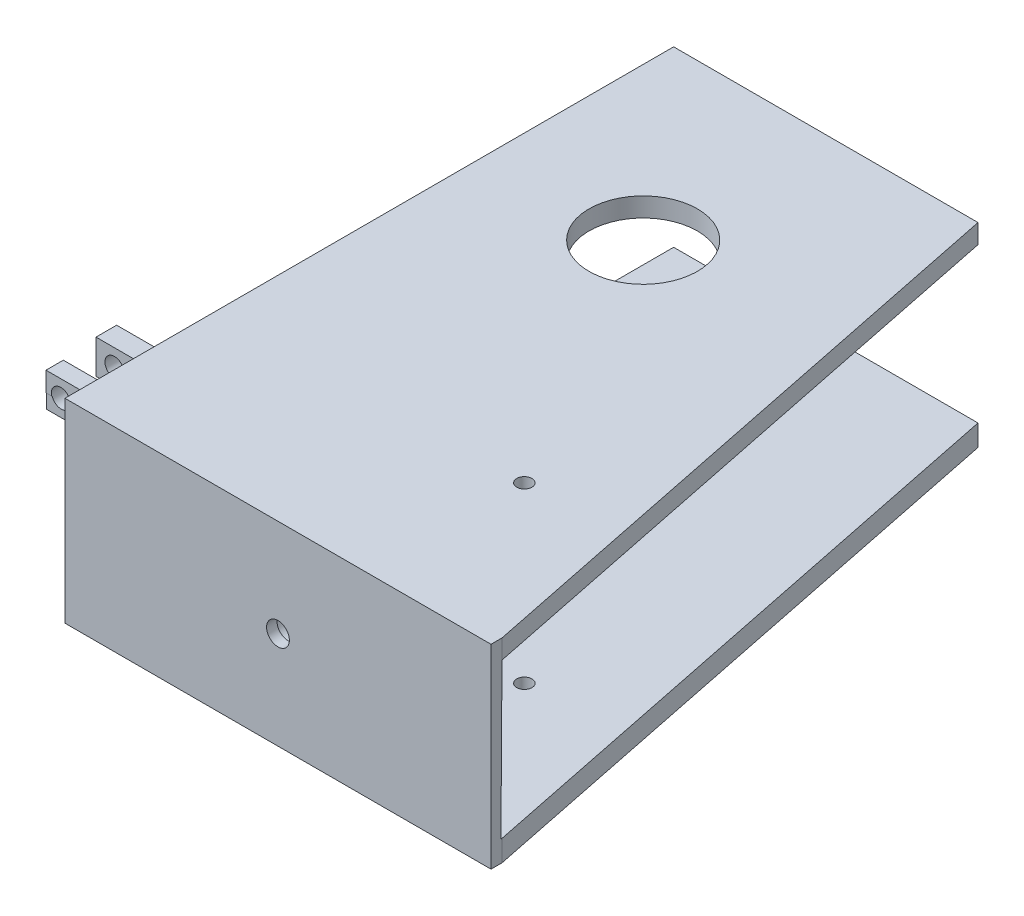
ISO-10303-21;
HEADER;
FILE_DESCRIPTION(('STEP AP214'),'2;1');
FILE_NAME('part.step','',(''),(''),'','','');
FILE_SCHEMA(('AUTOMOTIVE_DESIGN { 1 0 10303 214 1 1 1 1 }'));
ENDSEC;
DATA;
#1=APPLICATION_CONTEXT('core data for automotive mechanical design processes');
#2=APPLICATION_PROTOCOL_DEFINITION('international standard','automotive_design',2000,#1);
#3=PRODUCT_CONTEXT('',#1,'mechanical');
#4=PRODUCT('Part','Part','',(#3));
#5=PRODUCT_RELATED_PRODUCT_CATEGORY('part','',(#4));
#6=PRODUCT_DEFINITION_FORMATION('','',#4);
#7=PRODUCT_DEFINITION_CONTEXT('part definition',#1,'design');
#8=PRODUCT_DEFINITION('design','',#6,#7);
#9=PRODUCT_DEFINITION_SHAPE('','',#8);
#10=(LENGTH_UNIT() NAMED_UNIT(*) SI_UNIT(.MILLI.,.METRE.));
#11=(NAMED_UNIT(*) PLANE_ANGLE_UNIT() SI_UNIT($,.RADIAN.));
#12=(NAMED_UNIT(*) SI_UNIT($,.STERADIAN.) SOLID_ANGLE_UNIT());
#13=UNCERTAINTY_MEASURE_WITH_UNIT(LENGTH_MEASURE(1.E-05),#10,'distance_accuracy_value','');
#14=(GEOMETRIC_REPRESENTATION_CONTEXT(3) GLOBAL_UNCERTAINTY_ASSIGNED_CONTEXT((#13)) GLOBAL_UNIT_ASSIGNED_CONTEXT((#10,
#11,#12)) REPRESENTATION_CONTEXT('',''));
#15=CARTESIAN_POINT('',(0.,0.,0.));
#16=DIRECTION('',(0.,0.,1.));
#17=DIRECTION('',(1.,0.,0.));
#18=AXIS2_PLACEMENT_3D('',#15,#16,#17);
#19=CARTESIAN_POINT('',(23.876,-11.1057730017101,193.729110331207));
#20=DIRECTION('',(0.,1.,0.));
#21=DIRECTION('',(0.,0.,1.));
#22=AXIS2_PLACEMENT_3D('',#19,#20,#21);
#23=PLANE('',#22);
#24=DIRECTION('',(0.,0.,-1.));
#25=VECTOR('',#24,1.);
#26=CARTESIAN_POINT('',(-12.0893148253809,-11.1057730017101,207.01));
#27=LINE('',#26,#25);
#28=CARTESIAN_POINT('',(-12.0893148253809,-11.1057730017101,193.548));
#29=VERTEX_POINT('',#28);
#30=CARTESIAN_POINT('',(-12.0893148253809,-11.1057730017101,193.729110331207));
#31=VERTEX_POINT('',#30);
#32=EDGE_CURVE('E195',#29,#31,#27,.F.);
#33=ORIENTED_EDGE('',*,*,#32,.F.);
#34=DIRECTION('',(-1.,0.,0.));
#35=VECTOR('',#34,1.);
#36=CARTESIAN_POINT('',(23.876,-11.1057730017101,193.548));
#37=LINE('',#36,#35);
#38=CARTESIAN_POINT('',(23.876,-11.1057730017101,193.548));
#39=VERTEX_POINT('',#38);
#40=EDGE_CURVE('E205',#39,#29,#37,.T.);
#41=ORIENTED_EDGE('',*,*,#40,.F.);
#42=DIRECTION('',(0.,0.,-1.));
#43=VECTOR('',#42,1.);
#44=CARTESIAN_POINT('',(23.876,-11.1057730017101,193.729110331207));
#45=LINE('',#44,#43);
#46=CARTESIAN_POINT('',(23.876,-11.1057730017101,193.729110331207));
#47=VERTEX_POINT('',#46);
#48=EDGE_CURVE('E253',#47,#39,#45,.T.);
#49=ORIENTED_EDGE('',*,*,#48,.F.);
#50=DIRECTION('',(-1.,0.,0.));
#51=VECTOR('',#50,1.);
#52=CARTESIAN_POINT('',(23.876,-11.1057730017101,193.729110331207));
#53=LINE('',#52,#51);
#54=EDGE_CURVE('E208',#47,#31,#53,.T.);
#55=ORIENTED_EDGE('',*,*,#54,.T.);
#56=EDGE_LOOP('',(#33,#41,#49,#55));
#57=FACE_BOUND('',#56,.T.);
#58=ADVANCED_FACE('F33',(#57),#23,.F.);
#59=DIRECTION('',(0.,0.,-1.));
#60=VECTOR('',#59,1.);
#61=CARTESIAN_POINT('',(-19.7339467037339,-11.1057730017101,207.01));
#62=LINE('',#61,#60);
#63=CARTESIAN_POINT('',(-19.7339467037339,-11.1057730017101,193.729110331207));
#64=VERTEX_POINT('',#63);
#65=CARTESIAN_POINT('',(-19.7339467037339,-11.1057730017101,193.548));
#66=VERTEX_POINT('',#65);
#67=EDGE_CURVE('E51',#64,#66,#62,.T.);
#68=ORIENTED_EDGE('',*,*,#67,.F.);
#69=CARTESIAN_POINT('',(-22.098,-11.1057730017101,193.729110331207));
#70=VERTEX_POINT('',#69);
#71=EDGE_CURVE('E262',#64,#70,#53,.T.);
#72=ORIENTED_EDGE('',*,*,#71,.T.);
#73=DIRECTION('',(0.,0.,-1.));
#74=VECTOR('',#73,1.);
#75=CARTESIAN_POINT('',(-22.098,-11.1057730017101,193.729110331207));
#76=LINE('',#75,#74);
#77=CARTESIAN_POINT('',(-22.098,-11.1057730017101,193.548));
#78=VERTEX_POINT('',#77);
#79=EDGE_CURVE('E242',#70,#78,#76,.T.);
#80=ORIENTED_EDGE('',*,*,#79,.T.);
#81=EDGE_CURVE('E37',#66,#78,#37,.T.);
#82=ORIENTED_EDGE('',*,*,#81,.F.);
#83=EDGE_LOOP('',(#68,#72,#80,#82));
#84=FACE_BOUND('',#83,.T.);
#85=ADVANCED_FACE('F409',(#84),#23,.F.);
#86=CARTESIAN_POINT('',(23.876,-2.91945477341836,193.729110331207));
#87=DIRECTION('',(0.,0.,-1.));
#88=DIRECTION('',(-1.,0.,0.));
#89=AXIS2_PLACEMENT_3D('',#86,#87,#88);
#90=PLANE('',#89);
#91=CARTESIAN_POINT('',(-15.9116307645574,-10.0235836399452,193.729110331207));
#92=DIRECTION('',(0.,0.,-1.));
#93=DIRECTION('',(-1.,0.,0.));
#94=AXIS2_PLACEMENT_3D('',#91,#92,#93);
#95=CIRCLE('',#94,3.97256);
#96=EDGE_CURVE('E209',#31,#64,#95,.F.);
#97=ORIENTED_EDGE('',*,*,#96,.F.);
#98=ORIENTED_EDGE('',*,*,#54,.F.);
#99=DIRECTION('',(0.,-1.,0.));
#100=VECTOR('',#99,1.);
#101=CARTESIAN_POINT('',(23.876,-2.91945477341836,193.729110331207));
#102=LINE('',#101,#100);
#103=CARTESIAN_POINT('',(23.876,-2.91945477341836,193.729110331207));
#104=VERTEX_POINT('',#103);
#105=EDGE_CURVE('E256',#104,#47,#102,.T.);
#106=ORIENTED_EDGE('',*,*,#105,.F.);
#107=DIRECTION('',(-1.,0.,0.));
#108=VECTOR('',#107,1.);
#109=CARTESIAN_POINT('',(23.876,-2.91945477341836,193.729110331207));
#110=LINE('',#109,#108);
#111=CARTESIAN_POINT('',(0.,-2.91945477341836,193.729110331207));
#112=VERTEX_POINT('',#111);
#113=EDGE_CURVE('E266',#104,#112,#110,.T.);
#114=ORIENTED_EDGE('',*,*,#113,.T.);
#115=CARTESIAN_POINT('',(-22.098,-2.91945477341836,193.729110331207));
#116=VERTEX_POINT('',#115);
#117=EDGE_CURVE('E265',#112,#116,#110,.T.);
#118=ORIENTED_EDGE('',*,*,#117,.T.);
#119=DIRECTION('',(0.,-1.,0.));
#120=VECTOR('',#119,1.);
#121=CARTESIAN_POINT('',(-22.098,-2.91945477341836,193.729110331207));
#122=LINE('',#121,#120);
#123=EDGE_CURVE('E239',#116,#70,#122,.T.);
#124=ORIENTED_EDGE('',*,*,#123,.T.);
#125=ORIENTED_EDGE('',*,*,#71,.F.);
#126=EDGE_LOOP('',(#97,#98,#106,#114,#118,#124,#125));
#127=FACE_BOUND('',#126,.T.);
#128=ADVANCED_FACE('F414',(#127),#90,.F.);
#129=CARTESIAN_POINT('',(23.876,-11.1057730017101,186.496169951431));
#130=DIRECTION('',(0.,0.,1.));
#131=DIRECTION('',(1.,0.,0.));
#132=AXIS2_PLACEMENT_3D('',#129,#130,#131);
#133=PLANE('',#132);
#134=DIRECTION('',(0.,1.,0.));
#135=VECTOR('',#134,1.);
#136=CARTESIAN_POINT('',(23.876,-11.1057730017101,186.496169951431));
#137=LINE('',#136,#135);
#138=CARTESIAN_POINT('',(23.876,-17.127712506472,186.496169951431));
#139=VERTEX_POINT('',#138);
#140=CARTESIAN_POINT('',(23.876,-2.91945477341836,186.496169951431));
#141=VERTEX_POINT('',#140);
#142=EDGE_CURVE('E255',#139,#141,#137,.T.);
#143=ORIENTED_EDGE('',*,*,#142,.F.);
#144=DIRECTION('',(1.,0.,0.));
#145=VECTOR('',#144,1.);
#146=CARTESIAN_POINT('',(-81.534,-17.127712506472,186.496169951431));
#147=LINE('',#146,#145);
#148=CARTESIAN_POINT('',(-22.098,-17.127712506472,186.496169951431));
#149=VERTEX_POINT('',#148);
#150=EDGE_CURVE('E221',#149,#139,#147,.T.);
#151=ORIENTED_EDGE('',*,*,#150,.F.);
#152=DIRECTION('',(0.,1.,0.));
#153=VECTOR('',#152,1.);
#154=CARTESIAN_POINT('',(-22.098,-11.1057730017101,186.496169951431));
#155=LINE('',#154,#153);
#156=CARTESIAN_POINT('',(-22.098,-2.91945477341836,186.496169951431));
#157=VERTEX_POINT('',#156);
#158=EDGE_CURVE('E251',#149,#157,#155,.T.);
#159=ORIENTED_EDGE('',*,*,#158,.T.);
#160=DIRECTION('',(-1.,0.,0.));
#161=VECTOR('',#160,1.);
#162=CARTESIAN_POINT('',(23.876,-2.91945477341836,186.496169951431));
#163=LINE('',#162,#161);
#164=CARTESIAN_POINT('',(0.,-2.91945477341836,186.496169951431));
#165=VERTEX_POINT('',#164);
#166=EDGE_CURVE('E263',#165,#157,#163,.T.);
#167=ORIENTED_EDGE('',*,*,#166,.F.);
#168=EDGE_CURVE('E259',#141,#165,#163,.T.);
#169=ORIENTED_EDGE('',*,*,#168,.F.);
#170=EDGE_LOOP('',(#143,#151,#159,#167,#169));
#171=FACE_BOUND('',#170,.T.);
#172=CARTESIAN_POINT('',(-15.9116307645574,-10.0235836399452,186.496169951431));
#173=DIRECTION('',(0.,0.,1.));
#174=DIRECTION('',(1.,0.,0.));
#175=AXIS2_PLACEMENT_3D('',#172,#173,#174);
#176=CIRCLE('',#175,3.97256);
#177=CARTESIAN_POINT('',(-11.9390707645574,-10.0235836399452,186.496169951431));
#178=VERTEX_POINT('',#177);
#179=EDGE_CURVE('E427',#178,#178,#176,.F.);
#180=ORIENTED_EDGE('',*,*,#179,.F.);
#181=EDGE_LOOP('',(#180));
#182=FACE_BOUND('',#181,.T.);
#183=ADVANCED_FACE('F418',(#171,#182),#133,.F.);
#184=CARTESIAN_POINT('',(0.,0.,193.548));
#185=DIRECTION('',(0.,0.,1.));
#186=DIRECTION('',(1.,0.,0.));
#187=AXIS2_PLACEMENT_3D('',#184,#185,#186);
#188=PLANE('',#187);
#189=ORIENTED_EDGE('',*,*,#40,.T.);
#190=CARTESIAN_POINT('',(-15.9116307645574,-10.0235836399452,193.548));
#191=DIRECTION('',(0.,0.,1.));
#192=DIRECTION('',(1.,0.,0.));
#193=AXIS2_PLACEMENT_3D('',#190,#191,#192);
#194=CIRCLE('',#193,3.97256);
#195=EDGE_CURVE('E191',#29,#66,#194,.F.);
#196=ORIENTED_EDGE('',*,*,#195,.T.);
#197=ORIENTED_EDGE('',*,*,#81,.T.);
#198=DIRECTION('',(0.,-1.,0.));
#199=VECTOR('',#198,1.);
#200=CARTESIAN_POINT('',(-22.098,-11.1057730017101,193.548));
#201=LINE('',#200,#199);
#202=CARTESIAN_POINT('',(-22.098,-17.127712506472,193.548));
#203=VERTEX_POINT('',#202);
#204=EDGE_CURVE('E216',#78,#203,#201,.T.);
#205=ORIENTED_EDGE('',*,*,#204,.T.);
#206=DIRECTION('',(1.,0.,0.));
#207=VECTOR('',#206,1.);
#208=CARTESIAN_POINT('',(-22.098,-17.127712506472,193.548));
#209=LINE('',#208,#207);
#210=CARTESIAN_POINT('',(23.876,-17.127712506472,193.548));
#211=VERTEX_POINT('',#210);
#212=EDGE_CURVE('E219',#203,#211,#209,.T.);
#213=ORIENTED_EDGE('',*,*,#212,.T.);
#214=DIRECTION('',(0.,1.,0.));
#215=VECTOR('',#214,1.);
#216=CARTESIAN_POINT('',(23.876,-17.127712506472,193.548));
#217=LINE('',#216,#215);
#218=EDGE_CURVE('E215',#211,#39,#217,.T.);
#219=ORIENTED_EDGE('',*,*,#218,.T.);
#220=EDGE_LOOP('',(#189,#196,#197,#205,#213,#219));
#221=FACE_BOUND('',#220,.T.);
#222=ADVANCED_FACE('F212',(#221),#188,.T.);
#223=CARTESIAN_POINT('',(22.86,-17.127712506472,171.341437727139));
#224=DIRECTION('',(0.,0.,-1.));
#225=DIRECTION('',(-1.,0.,0.));
#226=AXIS2_PLACEMENT_3D('',#223,#224,#225);
#227=PLANE('',#226);
#228=DIRECTION('',(-1.,0.,0.));
#229=VECTOR('',#228,1.);
#230=CARTESIAN_POINT('',(22.86,-2.91945477341836,171.341437727139));
#231=LINE('',#230,#229);
#232=CARTESIAN_POINT('',(22.86,-2.91945477341836,171.341437727139));
#233=VERTEX_POINT('',#232);
#234=CARTESIAN_POINT('',(0.,-2.91945477341836,171.341437727139));
#235=VERTEX_POINT('',#234);
#236=EDGE_CURVE('E59',#233,#235,#231,.T.);
#237=ORIENTED_EDGE('',*,*,#236,.T.);
#238=CARTESIAN_POINT('',(-23.622,-2.91945477341836,171.341437727139));
#239=VERTEX_POINT('',#238);
#240=EDGE_CURVE('E461',#235,#239,#231,.T.);
#241=ORIENTED_EDGE('',*,*,#240,.T.);
#242=DIRECTION('',(0.,-1.,0.));
#243=VECTOR('',#242,1.);
#244=CARTESIAN_POINT('',(-23.622,-17.127712506472,171.341437727139));
#245=LINE('',#244,#243);
#246=CARTESIAN_POINT('',(-23.622,-17.127712506472,171.341437727139));
#247=VERTEX_POINT('',#246);
#248=EDGE_CURVE('E436',#239,#247,#245,.T.);
#249=ORIENTED_EDGE('',*,*,#248,.T.);
#250=DIRECTION('',(-1.,0.,0.));
#251=VECTOR('',#250,1.);
#252=CARTESIAN_POINT('',(22.86,-17.127712506472,171.341437727139));
#253=LINE('',#252,#251);
#254=CARTESIAN_POINT('',(22.86,-17.127712506472,171.341437727139));
#255=VERTEX_POINT('',#254);
#256=EDGE_CURVE('E460',#255,#247,#253,.T.);
#257=ORIENTED_EDGE('',*,*,#256,.F.);
#258=DIRECTION('',(0.,-1.,0.));
#259=VECTOR('',#258,1.);
#260=CARTESIAN_POINT('',(22.86,-17.127712506472,171.341437727139));
#261=LINE('',#260,#259);
#262=EDGE_CURVE('E448',#233,#255,#261,.T.);
#263=ORIENTED_EDGE('',*,*,#262,.F.);
#264=EDGE_LOOP('',(#237,#241,#249,#257,#263));
#265=FACE_BOUND('',#264,.T.);
#266=CARTESIAN_POINT('',(-15.9116307645574,-10.0235836399452,171.341437727139));
#267=DIRECTION('',(0.,0.,-1.));
#268=DIRECTION('',(-1.,0.,0.));
#269=AXIS2_PLACEMENT_3D('',#266,#267,#268);
#270=CIRCLE('',#269,3.97256);
#271=CARTESIAN_POINT('',(-19.8841907645574,-10.0235836399452,171.341437727139));
#272=VERTEX_POINT('',#271);
#273=EDGE_CURVE('E200',#272,#272,#270,.F.);
#274=ORIENTED_EDGE('',*,*,#273,.F.);
#275=EDGE_LOOP('',(#274));
#276=FACE_BOUND('',#275,.T.);
#277=ADVANCED_FACE('F464',(#265,#276),#227,.F.);
#278=CARTESIAN_POINT('',(22.86,-2.91945477341836,162.730794417882));
#279=DIRECTION('',(0.,0.,1.));
#280=DIRECTION('',(1.,0.,0.));
#281=AXIS2_PLACEMENT_3D('',#278,#279,#280);
#282=PLANE('',#281);
#283=DIRECTION('',(-1.,0.,0.));
#284=VECTOR('',#283,1.);
#285=CARTESIAN_POINT('',(22.86,-17.127712506472,162.730794417882));
#286=LINE('',#285,#284);
#287=CARTESIAN_POINT('',(22.86,-17.127712506472,162.730794417882));
#288=VERTEX_POINT('',#287);
#289=CARTESIAN_POINT('',(-23.622,-17.127712506472,162.730794417882));
#290=VERTEX_POINT('',#289);
#291=EDGE_CURVE('E458',#288,#290,#286,.T.);
#292=ORIENTED_EDGE('',*,*,#291,.T.);
#293=DIRECTION('',(0.,1.,0.));
#294=VECTOR('',#293,1.);
#295=CARTESIAN_POINT('',(-23.622,-2.91945477341836,162.730794417882));
#296=LINE('',#295,#294);
#297=CARTESIAN_POINT('',(-23.622,-2.91945477341836,162.730794417882));
#298=VERTEX_POINT('',#297);
#299=EDGE_CURVE('E442',#290,#298,#296,.T.);
#300=ORIENTED_EDGE('',*,*,#299,.T.);
#301=DIRECTION('',(-1.,0.,0.));
#302=VECTOR('',#301,1.);
#303=CARTESIAN_POINT('',(22.86,-2.91945477341836,162.730794417882));
#304=LINE('',#303,#302);
#305=CARTESIAN_POINT('',(0.,-2.91945477341836,162.730794417882));
#306=VERTEX_POINT('',#305);
#307=EDGE_CURVE('E454',#306,#298,#304,.T.);
#308=ORIENTED_EDGE('',*,*,#307,.F.);
#309=CARTESIAN_POINT('',(22.86,-2.91945477341836,162.730794417882));
#310=VERTEX_POINT('',#309);
#311=EDGE_CURVE('E455',#310,#306,#304,.T.);
#312=ORIENTED_EDGE('',*,*,#311,.F.);
#313=DIRECTION('',(0.,1.,0.));
#314=VECTOR('',#313,1.);
#315=CARTESIAN_POINT('',(22.86,-2.91945477341836,162.730794417882));
#316=LINE('',#315,#314);
#317=EDGE_CURVE('E452',#288,#310,#316,.T.);
#318=ORIENTED_EDGE('',*,*,#317,.F.);
#319=EDGE_LOOP('',(#292,#300,#308,#312,#318));
#320=FACE_BOUND('',#319,.T.);
#321=CARTESIAN_POINT('',(-15.9116307645574,-10.0235836399452,162.730794417882));
#322=DIRECTION('',(0.,0.,1.));
#323=DIRECTION('',(1.,0.,0.));
#324=AXIS2_PLACEMENT_3D('',#321,#322,#323);
#325=CIRCLE('',#324,3.97256);
#326=CARTESIAN_POINT('',(-11.9390707645574,-10.0235836399452,162.730794417882));
#327=VERTEX_POINT('',#326);
#328=EDGE_CURVE('E891',#327,#327,#325,.F.);
#329=ORIENTED_EDGE('',*,*,#328,.F.);
#330=EDGE_LOOP('',(#329));
#331=FACE_BOUND('',#330,.T.);
#332=ADVANCED_FACE('F479',(#320,#331),#282,.F.);
#333=CARTESIAN_POINT('',(208.534,-2.91945477341836,203.357682979943));
#334=DIRECTION('',(0.,-1.,0.));
#335=DIRECTION('',(0.,0.,-1.));
#336=AXIS2_PLACEMENT_3D('',#333,#334,#335);
#337=PLANE('',#336);
#338=CARTESIAN_POINT('',(126.414802626394,-2.91945477341837,142.640423394958));
#339=DIRECTION('',(0.,-1.,0.));
#340=DIRECTION('',(0.,0.,-1.));
#341=AXIS2_PLACEMENT_3D('',#338,#339,#340);
#342=CIRCLE('',#341,3.175);
#343=CARTESIAN_POINT('',(126.414802626394,-2.91945477341837,139.465423394958));
#344=VERTEX_POINT('',#343);
#345=EDGE_CURVE('E280',#344,#344,#342,.T.);
#346=ORIENTED_EDGE('',*,*,#345,.F.);
#347=EDGE_LOOP('',(#346));
#348=FACE_BOUND('',#347,.T.);
#349=CARTESIAN_POINT('',(63.5,-2.91945477341835,30.1296829799427));
#350=DIRECTION('',(0.,-1.,0.));
#351=DIRECTION('',(0.,0.,-1.));
#352=AXIS2_PLACEMENT_3D('',#349,#350,#351);
#353=CIRCLE('',#352,22.606);
#354=CARTESIAN_POINT('',(63.5,-2.91945477341835,7.5236829799427));
#355=VERTEX_POINT('',#354);
#356=EDGE_CURVE('E287',#355,#355,#353,.F.);
#357=ORIENTED_EDGE('',*,*,#356,.T.);
#358=EDGE_LOOP('',(#357));
#359=FACE_BOUND('',#358,.T.);
#360=DIRECTION('',(0.,0.,1.));
#361=VECTOR('',#360,1.);
#362=CARTESIAN_POINT('',(0.,-2.91945477341836,203.357682979943));
#363=LINE('',#362,#361);
#364=EDGE_CURVE('E302',#235,#165,#363,.T.);
#365=ORIENTED_EDGE('',*,*,#364,.F.);
#366=ORIENTED_EDGE('',*,*,#236,.F.);
#367=DIRECTION('',(0.,0.,1.));
#368=VECTOR('',#367,1.);
#369=CARTESIAN_POINT('',(22.86,-2.91945477341836,171.341437727139));
#370=LINE('',#369,#368);
#371=EDGE_CURVE('E445',#310,#233,#370,.T.);
#372=ORIENTED_EDGE('',*,*,#371,.F.);
#373=ORIENTED_EDGE('',*,*,#311,.T.);
#374=CARTESIAN_POINT('',(0.,-2.91945477341835,-46.0703170200573));
#375=VERTEX_POINT('',#374);
#376=EDGE_CURVE('E297',#375,#306,#363,.T.);
#377=ORIENTED_EDGE('',*,*,#376,.F.);
#378=DIRECTION('',(-1.,0.,0.));
#379=VECTOR('',#378,1.);
#380=CARTESIAN_POINT('',(208.534,-2.91945477341835,-46.0703170200573));
#381=LINE('',#380,#379);
#382=CARTESIAN_POINT('',(127.,-2.91945477341835,-46.0703170200573));
#383=VERTEX_POINT('',#382);
#384=EDGE_CURVE('E308',#383,#375,#381,.T.);
#385=ORIENTED_EDGE('',*,*,#384,.F.);
#386=DIRECTION('',(0.199568997239386,0.,0.979883776445384));
#387=VECTOR('',#386,1.);
#388=CARTESIAN_POINT('',(127.,-2.91945477341835,-46.0703170200573));
#389=LINE('',#388,#387);
#390=CARTESIAN_POINT('',(177.8,-2.91945477341836,203.357682979943));
#391=VERTEX_POINT('',#390);
#392=EDGE_CURVE('E321',#383,#391,#389,.T.);
#393=ORIENTED_EDGE('',*,*,#392,.T.);
#394=DIRECTION('',(-1.,0.,0.));
#395=VECTOR('',#394,1.);
#396=CARTESIAN_POINT('',(208.534,-2.91945477341836,203.357682979943));
#397=LINE('',#396,#395);
#398=CARTESIAN_POINT('',(0.,-2.91945477341836,203.357682979943));
#399=VERTEX_POINT('',#398);
#400=EDGE_CURVE('E316',#391,#399,#397,.T.);
#401=ORIENTED_EDGE('',*,*,#400,.T.);
#402=EDGE_CURVE('E296',#112,#399,#363,.T.);
#403=ORIENTED_EDGE('',*,*,#402,.F.);
#404=ORIENTED_EDGE('',*,*,#113,.F.);
#405=DIRECTION('',(0.,0.,1.));
#406=VECTOR('',#405,1.);
#407=CARTESIAN_POINT('',(23.876,-2.91945477341836,186.496169951431));
#408=LINE('',#407,#406);
#409=EDGE_CURVE('E245',#141,#104,#408,.T.);
#410=ORIENTED_EDGE('',*,*,#409,.F.);
#411=ORIENTED_EDGE('',*,*,#168,.T.);
#412=EDGE_LOOP('',(#365,#366,#372,#373,#377,#385,#393,#401,#403,#404,#410,#411));
#413=FACE_BOUND('',#412,.T.);
#414=ADVANCED_FACE('F484',(#348,#359,#413),#337,.T.);
#415=CARTESIAN_POINT('',(88.9,-35.56,-2.54));
#416=DIRECTION('',(0.,0.,1.));
#417=DIRECTION('',(1.,0.,0.));
#418=AXIS2_PLACEMENT_3D('',#415,#416,#417);
#419=CYLINDRICAL_SURFACE('',#418,9.023236634492);
#420=CARTESIAN_POINT('',(88.9,-35.56,203.577965846683));
#421=DIRECTION('',(0.,-0.00674859592335364,-0.999977227967249));
#422=DIRECTION('',(0.,-0.999977227967249,0.00674859592335364));
#423=AXIS2_PLACEMENT_3D('',#420,#421,#422);
#424=ELLIPSE('',#423,9.02344211661141,9.023236634492);
#425=CARTESIAN_POINT('',(88.9,-44.583236634492,203.638861411366));
#426=VERTEX_POINT('',#425);
#427=EDGE_CURVE('E11',#426,#426,#424,.T.);
#428=ORIENTED_EDGE('',*,*,#427,.T.);
#429=EDGE_LOOP('',(#428));
#430=FACE_BOUND('',#429,.T.);
#431=CARTESIAN_POINT('',(88.9,-35.56,192.958769134962));
#432=DIRECTION('',(0.,0.,-1.));
#433=DIRECTION('',(-1.,0.,0.));
#434=AXIS2_PLACEMENT_3D('',#431,#432,#433);
#435=CIRCLE('',#434,9.023236634492);
#436=CARTESIAN_POINT('',(79.876763365508,-35.56,192.958769134962));
#437=VERTEX_POINT('',#436);
#438=EDGE_CURVE('E268',#437,#437,#435,.F.);
#439=ORIENTED_EDGE('',*,*,#438,.T.);
#440=EDGE_LOOP('',(#439));
#441=FACE_BOUND('',#440,.T.);
#442=ADVANCED_FACE('F385',(#430,#441),#419,.T.);
#443=CARTESIAN_POINT('',(88.9,-35.56,-2.54));
#444=DIRECTION('',(0.,0.,1.));
#445=DIRECTION('',(1.,0.,0.));
#446=AXIS2_PLACEMENT_3D('',#443,#444,#445);
#447=CYLINDRICAL_SURFACE('',#446,5.41394198069519);
#448=CARTESIAN_POINT('',(88.9,-35.56,203.577965846683));
#449=DIRECTION('',(0.,-0.00674859592335364,-0.999977227967249));
#450=DIRECTION('',(0.,-0.999977227967249,0.00674859592335364));
#451=AXIS2_PLACEMENT_3D('',#448,#449,#450);
#452=ELLIPSE('',#451,5.41406526996684,5.41394198069519);
#453=CARTESIAN_POINT('',(88.9,-40.9739419806952,203.614503185493));
#454=VERTEX_POINT('',#453);
#455=EDGE_CURVE('E271',#454,#454,#452,.T.);
#456=ORIENTED_EDGE('',*,*,#455,.F.);
#457=EDGE_LOOP('',(#456));
#458=FACE_BOUND('',#457,.T.);
#459=CARTESIAN_POINT('',(88.9,-35.56,192.958769134962));
#460=DIRECTION('',(0.,0.,-1.));
#461=DIRECTION('',(-1.,0.,0.));
#462=AXIS2_PLACEMENT_3D('',#459,#460,#461);
#463=CIRCLE('',#462,5.41394198069519);
#464=CARTESIAN_POINT('',(83.4860580193048,-35.56,192.958769134962));
#465=VERTEX_POINT('',#464);
#466=EDGE_CURVE('E252',#465,#465,#463,.F.);
#467=ORIENTED_EDGE('',*,*,#466,.F.);
#468=EDGE_LOOP('',(#467));
#469=FACE_BOUND('',#468,.T.);
#470=ADVANCED_FACE('F382',(#458,#469),#447,.F.);
#471=CARTESIAN_POINT('',(208.534,-67.3527388570609,203.792527080522));
#472=DIRECTION('',(0.,-0.00674859592335364,-0.999977227967249));
#473=DIRECTION('',(0.,0.999977227967249,-0.00674859592335364));
#474=AXIS2_PLACEMENT_3D('',#471,#472,#473);
#475=PLANE('',#474);
#476=CARTESIAN_POINT('',(88.9,-35.56,203.577965846683));
#477=DIRECTION('',(0.,-0.00674859592335364,-0.999977227967249));
#478=DIRECTION('',(0.,0.999977227967249,-0.00674859592335364));
#479=AXIS2_PLACEMENT_3D('',#476,#477,#478);
#480=ELLIPSE('',#479,4.7626084542757,4.7625);
#481=CARTESIAN_POINT('',(88.9,-30.7975,203.545824926684));
#482=VERTEX_POINT('',#481);
#483=EDGE_CURVE('E276',#482,#482,#480,.F.);
#484=ORIENTED_EDGE('',*,*,#483,.T.);
#485=EDGE_LOOP('',(#484));
#486=FACE_BOUND('',#485,.T.);
#487=ORIENTED_EDGE('',*,*,#455,.T.);
#488=EDGE_LOOP('',(#487));
#489=FACE_BOUND('',#488,.T.);
#490=ADVANCED_FACE('F380',(#486,#489),#475,.T.);
#491=CARTESIAN_POINT('',(0.,4.572,207.929682979943));
#492=DIRECTION('',(0.,0.,-1.));
#493=DIRECTION('',(-1.,0.,0.));
#494=AXIS2_PLACEMENT_3D('',#491,#492,#493);
#495=PLANE('',#494);
#496=DIRECTION('',(0.,-1.,0.));
#497=VECTOR('',#496,1.);
#498=CARTESIAN_POINT('',(0.,4.572,207.929682979943));
#499=LINE('',#498,#497);
#500=CARTESIAN_POINT('',(0.,5.08,207.929682979943));
#501=VERTEX_POINT('',#500);
#502=CARTESIAN_POINT('',(0.,-76.2,207.929682979943));
#503=VERTEX_POINT('',#502);
#504=EDGE_CURVE('E359',#501,#503,#499,.T.);
#505=ORIENTED_EDGE('',*,*,#504,.T.);
#506=DIRECTION('',(1.,0.,0.));
#507=VECTOR('',#506,1.);
#508=CARTESIAN_POINT('',(177.8,-76.2,207.929682979943));
#509=LINE('',#508,#507);
#510=CARTESIAN_POINT('',(177.8,-76.2,207.929682979943));
#511=VERTEX_POINT('',#510);
#512=EDGE_CURVE('E323',#503,#511,#509,.T.);
#513=ORIENTED_EDGE('',*,*,#512,.T.);
#514=DIRECTION('',(0.,-1.,0.));
#515=VECTOR('',#514,1.);
#516=CARTESIAN_POINT('',(177.8,4.572,207.929682979943));
#517=LINE('',#516,#515);
#518=CARTESIAN_POINT('',(177.8,5.08,207.929682979943));
#519=VERTEX_POINT('',#518);
#520=EDGE_CURVE('E357',#519,#511,#517,.T.);
#521=ORIENTED_EDGE('',*,*,#520,.F.);
#522=DIRECTION('',(1.,0.,0.));
#523=VECTOR('',#522,1.);
#524=CARTESIAN_POINT('',(177.8,5.08,207.929682979943));
#525=LINE('',#524,#523);
#526=EDGE_CURVE('E336',#501,#519,#525,.T.);
#527=ORIENTED_EDGE('',*,*,#526,.F.);
#528=EDGE_LOOP('',(#505,#513,#521,#527));
#529=FACE_BOUND('',#528,.T.);
#530=CARTESIAN_POINT('',(88.9,-35.56,207.929682979943));
#531=DIRECTION('',(0.,0.,-1.));
#532=DIRECTION('',(-1.,0.,0.));
#533=AXIS2_PLACEMENT_3D('',#530,#531,#532);
#534=CIRCLE('',#533,4.7625);
#535=CARTESIAN_POINT('',(84.1375,-35.56,207.929682979943));
#536=VERTEX_POINT('',#535);
#537=EDGE_CURVE('E272',#536,#536,#534,.F.);
#538=ORIENTED_EDGE('',*,*,#537,.F.);
#539=EDGE_LOOP('',(#538));
#540=FACE_BOUND('',#539,.T.);
#541=ADVANCED_FACE('F532',(#529,#540),#495,.F.);
#542=ORIENTED_EDGE('',*,*,#427,.F.);
#543=EDGE_LOOP('',(#542));
#544=FACE_BOUND('',#543,.T.);
#545=DIRECTION('',(-1.,0.,0.));
#546=VECTOR('',#545,1.);
#547=CARTESIAN_POINT('',(208.534,-67.3527388570609,203.792527080522));
#548=LINE('',#547,#546);
#549=CARTESIAN_POINT('',(177.8,-67.3527388570609,203.792527080522));
#550=VERTEX_POINT('',#549);
#551=CARTESIAN_POINT('',(0.,-67.3527388570609,203.792527080522));
#552=VERTEX_POINT('',#551);
#553=EDGE_CURVE('E314',#550,#552,#548,.T.);
#554=ORIENTED_EDGE('',*,*,#553,.T.);
#555=DIRECTION('',(0.,-0.999977227967249,0.00674859592335364));
#556=VECTOR('',#555,1.);
#557=CARTESIAN_POINT('',(0.,-67.3527388570609,203.792527080522));
#558=LINE('',#557,#556);
#559=EDGE_CURVE('E300',#399,#552,#558,.T.);
#560=ORIENTED_EDGE('',*,*,#559,.F.);
#561=ORIENTED_EDGE('',*,*,#400,.F.);
#562=DIRECTION('',(0.,0.999977227967249,-0.00674859592335364));
#563=VECTOR('',#562,1.);
#564=CARTESIAN_POINT('',(177.8,1.37221461615991,203.32871957784));
#565=LINE('',#564,#563);
#566=EDGE_CURVE('E43',#550,#391,#565,.T.);
#567=ORIENTED_EDGE('',*,*,#566,.F.);
#568=EDGE_LOOP('',(#554,#560,#561,#567));
#569=FACE_BOUND('',#568,.T.);
#570=ADVANCED_FACE('F506',(#544,#569),#475,.T.);
#571=CARTESIAN_POINT('',(0.,5.08,0.));
#572=DIRECTION('',(0.,-1.,0.));
#573=DIRECTION('',(0.,0.,-1.));
#574=AXIS2_PLACEMENT_3D('',#571,#572,#573);
#575=PLANE('',#574);
#576=CARTESIAN_POINT('',(126.414802626394,5.07999999999997,142.640423394958));
#577=DIRECTION('',(0.,-1.,0.));
#578=DIRECTION('',(0.,0.,-1.));
#579=AXIS2_PLACEMENT_3D('',#576,#577,#578);
#580=CIRCLE('',#579,3.175);
#581=CARTESIAN_POINT('',(126.414802626394,5.07999999999997,139.465423394958));
#582=VERTEX_POINT('',#581);
#583=EDGE_CURVE('E283',#582,#582,#580,.T.);
#584=ORIENTED_EDGE('',*,*,#583,.T.);
#585=EDGE_LOOP('',(#584));
#586=FACE_BOUND('',#585,.T.);
#587=DIRECTION('',(-0.199568997239386,0.,-0.979883776445383));
#588=VECTOR('',#587,1.);
#589=CARTESIAN_POINT('',(127.,5.08,-46.0703170200573));
#590=LINE('',#589,#588);
#591=CARTESIAN_POINT('',(177.8,5.08,203.357682979943));
#592=VERTEX_POINT('',#591);
#593=CARTESIAN_POINT('',(127.,5.08,-46.0703170200573));
#594=VERTEX_POINT('',#593);
#595=EDGE_CURVE('E342',#592,#594,#590,.T.);
#596=ORIENTED_EDGE('',*,*,#595,.T.);
#597=DIRECTION('',(-1.,0.,0.));
#598=VECTOR('',#597,1.);
#599=CARTESIAN_POINT('',(0.,5.08,-46.0703170200573));
#600=LINE('',#599,#598);
#601=CARTESIAN_POINT('',(0.,5.08,-46.0703170200573));
#602=VERTEX_POINT('',#601);
#603=EDGE_CURVE('E344',#594,#602,#600,.T.);
#604=ORIENTED_EDGE('',*,*,#603,.T.);
#605=DIRECTION('',(0.,0.,1.));
#606=VECTOR('',#605,1.);
#607=CARTESIAN_POINT('',(0.,5.08,207.929682979943));
#608=LINE('',#607,#606);
#609=EDGE_CURVE('E347',#602,#501,#608,.T.);
#610=ORIENTED_EDGE('',*,*,#609,.T.);
#611=ORIENTED_EDGE('',*,*,#526,.T.);
#612=DIRECTION('',(0.,0.,-1.));
#613=VECTOR('',#612,1.);
#614=CARTESIAN_POINT('',(177.8,5.08,203.357682979943));
#615=LINE('',#614,#613);
#616=EDGE_CURVE('E339',#519,#592,#615,.T.);
#617=ORIENTED_EDGE('',*,*,#616,.T.);
#618=EDGE_LOOP('',(#596,#604,#610,#611,#617));
#619=FACE_BOUND('',#618,.T.);
#620=CARTESIAN_POINT('',(63.5,5.08,30.1296829799427));
#621=DIRECTION('',(0.,-1.,0.));
#622=DIRECTION('',(0.,0.,-1.));
#623=AXIS2_PLACEMENT_3D('',#620,#621,#622);
#624=CIRCLE('',#623,22.606);
#625=CARTESIAN_POINT('',(63.5,5.08,7.5236829799427));
#626=VERTEX_POINT('',#625);
#627=EDGE_CURVE('E293',#626,#626,#624,.F.);
#628=ORIENTED_EDGE('',*,*,#627,.F.);
#629=EDGE_LOOP('',(#628));
#630=FACE_BOUND('',#629,.T.);
#631=ADVANCED_FACE('F492',(#586,#619,#630),#575,.F.);
#632=CARTESIAN_POINT('',(0.,-76.2,0.));
#633=DIRECTION('',(0.,-1.,0.));
#634=DIRECTION('',(0.,0.,-1.));
#635=AXIS2_PLACEMENT_3D('',#632,#633,#634);
#636=PLANE('',#635);
#637=CARTESIAN_POINT('',(126.414802626394,-76.2,142.640423394958));
#638=DIRECTION('',(0.,-1.,0.));
#639=DIRECTION('',(0.,0.,-1.));
#640=AXIS2_PLACEMENT_3D('',#637,#638,#639);
#641=CIRCLE('',#640,3.175);
#642=CARTESIAN_POINT('',(126.414802626394,-76.2,139.465423394958));
#643=VERTEX_POINT('',#642);
#644=EDGE_CURVE('E277',#643,#643,#641,.T.);
#645=ORIENTED_EDGE('',*,*,#644,.F.);
#646=EDGE_LOOP('',(#645));
#647=FACE_BOUND('',#646,.T.);
#648=DIRECTION('',(-1.,0.,0.));
#649=VECTOR('',#648,1.);
#650=CARTESIAN_POINT('',(0.,-76.2,-46.0703170200573));
#651=LINE('',#650,#649);
#652=CARTESIAN_POINT('',(127.,-76.2,-46.0703170200573));
#653=VERTEX_POINT('',#652);
#654=CARTESIAN_POINT('',(0.,-76.2,-46.0703170200573));
#655=VERTEX_POINT('',#654);
#656=EDGE_CURVE('E331',#653,#655,#651,.T.);
#657=ORIENTED_EDGE('',*,*,#656,.F.);
#658=DIRECTION('',(-0.199568997239386,0.,-0.979883776445383));
#659=VECTOR('',#658,1.);
#660=CARTESIAN_POINT('',(127.,-76.2,-46.0703170200573));
#661=LINE('',#660,#659);
#662=CARTESIAN_POINT('',(177.8,-76.2,203.357682979943));
#663=VERTEX_POINT('',#662);
#664=EDGE_CURVE('E329',#663,#653,#661,.T.);
#665=ORIENTED_EDGE('',*,*,#664,.F.);
#666=DIRECTION('',(0.,0.,-1.));
#667=VECTOR('',#666,1.);
#668=CARTESIAN_POINT('',(177.8,-76.2,203.357682979943));
#669=LINE('',#668,#667);
#670=EDGE_CURVE('E326',#511,#663,#669,.T.);
#671=ORIENTED_EDGE('',*,*,#670,.F.);
#672=ORIENTED_EDGE('',*,*,#512,.F.);
#673=DIRECTION('',(0.,0.,1.));
#674=VECTOR('',#673,1.);
#675=CARTESIAN_POINT('',(0.,-76.2,207.929682979943));
#676=LINE('',#675,#674);
#677=EDGE_CURVE('E334',#655,#503,#676,.T.);
#678=ORIENTED_EDGE('',*,*,#677,.F.);
#679=EDGE_LOOP('',(#657,#665,#671,#672,#678));
#680=FACE_BOUND('',#679,.T.);
#681=CARTESIAN_POINT('',(63.5,-76.2,30.1296829799427));
#682=DIRECTION('',(0.,-1.,0.));
#683=DIRECTION('',(0.,0.,-1.));
#684=AXIS2_PLACEMENT_3D('',#681,#682,#683);
#685=CIRCLE('',#684,22.606);
#686=CARTESIAN_POINT('',(63.5,-76.2,7.5236829799427));
#687=VERTEX_POINT('',#686);
#688=EDGE_CURVE('E290',#687,#687,#685,.F.);
#689=ORIENTED_EDGE('',*,*,#688,.T.);
#690=EDGE_LOOP('',(#689));
#691=FACE_BOUND('',#690,.T.);
#692=ADVANCED_FACE('F526',(#647,#680,#691),#636,.T.);
#693=CARTESIAN_POINT('',(208.534,-67.3527388570609,-46.0703170200573));
#694=DIRECTION('',(0.,1.,0.));
#695=DIRECTION('',(0.,0.,1.));
#696=AXIS2_PLACEMENT_3D('',#693,#694,#695);
#697=PLANE('',#696);
#698=CARTESIAN_POINT('',(126.414802626394,-67.3527388570609,142.640423394958));
#699=DIRECTION('',(0.,1.,0.));
#700=DIRECTION('',(0.,0.,1.));
#701=AXIS2_PLACEMENT_3D('',#698,#699,#700);
#702=CIRCLE('',#701,3.175);
#703=CARTESIAN_POINT('',(126.414802626394,-67.3527388570609,145.815423394958));
#704=VERTEX_POINT('',#703);
#705=EDGE_CURVE('E275',#704,#704,#702,.T.);
#706=ORIENTED_EDGE('',*,*,#705,.F.);
#707=EDGE_LOOP('',(#706));
#708=FACE_BOUND('',#707,.T.);
#709=DIRECTION('',(-1.,0.,0.));
#710=VECTOR('',#709,1.);
#711=CARTESIAN_POINT('',(208.534,-67.3527388570609,-46.0703170200573));
#712=LINE('',#711,#710);
#713=CARTESIAN_POINT('',(127.,-67.3527388570609,-46.0703170200573));
#714=VERTEX_POINT('',#713);
#715=CARTESIAN_POINT('',(0.,-67.3527388570609,-46.0703170200573));
#716=VERTEX_POINT('',#715);
#717=EDGE_CURVE('E311',#714,#716,#712,.T.);
#718=ORIENTED_EDGE('',*,*,#717,.T.);
#719=DIRECTION('',(0.,0.,-1.));
#720=VECTOR('',#719,1.);
#721=CARTESIAN_POINT('',(0.,-67.3527388570609,-46.0703170200573));
#722=LINE('',#721,#720);
#723=EDGE_CURVE('E306',#552,#716,#722,.T.);
#724=ORIENTED_EDGE('',*,*,#723,.F.);
#725=ORIENTED_EDGE('',*,*,#553,.F.);
#726=DIRECTION('',(0.,0.,1.));
#727=VECTOR('',#726,1.);
#728=CARTESIAN_POINT('',(177.8,-67.3527388570609,0.));
#729=LINE('',#728,#727);
#730=CARTESIAN_POINT('',(177.8,-67.3527388570609,203.357682979943));
#731=VERTEX_POINT('',#730);
#732=EDGE_CURVE('E366',#731,#550,#729,.T.);
#733=ORIENTED_EDGE('',*,*,#732,.F.);
#734=DIRECTION('',(-0.199568997239386,0.,-0.979883776445384));
#735=VECTOR('',#734,1.);
#736=CARTESIAN_POINT('',(127.,-67.3527388570609,-46.0703170200573));
#737=LINE('',#736,#735);
#738=EDGE_CURVE('E319',#731,#714,#737,.T.);
#739=ORIENTED_EDGE('',*,*,#738,.T.);
#740=EDGE_LOOP('',(#718,#724,#725,#733,#739));
#741=FACE_BOUND('',#740,.T.);
#742=CARTESIAN_POINT('',(63.5,-67.3527388570609,30.1296829799427));
#743=DIRECTION('',(0.,1.,0.));
#744=DIRECTION('',(0.,0.,1.));
#745=AXIS2_PLACEMENT_3D('',#742,#743,#744);
#746=CIRCLE('',#745,22.606);
#747=CARTESIAN_POINT('',(63.5,-67.3527388570609,52.7356829799427));
#748=VERTEX_POINT('',#747);
#749=EDGE_CURVE('E286',#748,#748,#746,.F.);
#750=ORIENTED_EDGE('',*,*,#749,.T.);
#751=EDGE_LOOP('',(#750));
#752=FACE_BOUND('',#751,.T.);
#753=ADVANCED_FACE('F511',(#708,#741,#752),#697,.T.);
#754=CARTESIAN_POINT('',(127.,5.08,-46.0703170200573));
#755=DIRECTION('',(-0.979883776445383,0.,0.199568997239386));
#756=DIRECTION('',(0.199568997239386,0.,0.979883776445384));
#757=AXIS2_PLACEMENT_3D('',#754,#755,#756);
#758=PLANE('',#757);
#759=ORIENTED_EDGE('',*,*,#392,.F.);
#760=DIRECTION('',(0.,-1.,0.));
#761=VECTOR('',#760,1.);
#762=CARTESIAN_POINT('',(127.,4.572,-46.0703170200573));
#763=LINE('',#762,#761);
#764=EDGE_CURVE('E354',#594,#383,#763,.T.);
#765=ORIENTED_EDGE('',*,*,#764,.F.);
#766=ORIENTED_EDGE('',*,*,#595,.F.);
#767=DIRECTION('',(0.,1.,0.));
#768=VECTOR('',#767,1.);
#769=CARTESIAN_POINT('',(177.8,-71.628,203.357682979943));
#770=LINE('',#769,#768);
#771=EDGE_CURVE('E349',#391,#592,#770,.T.);
#772=ORIENTED_EDGE('',*,*,#771,.F.);
#773=EDGE_LOOP('',(#759,#765,#766,#772));
#774=FACE_BOUND('',#773,.T.);
#775=ADVANCED_FACE('F500',(#774),#758,.F.);
#776=ORIENTED_EDGE('',*,*,#738,.F.);
#777=EDGE_CURVE('E350',#663,#731,#770,.T.);
#778=ORIENTED_EDGE('',*,*,#777,.F.);
#779=ORIENTED_EDGE('',*,*,#664,.T.);
#780=EDGE_CURVE('E353',#714,#653,#763,.T.);
#781=ORIENTED_EDGE('',*,*,#780,.F.);
#782=EDGE_LOOP('',(#776,#778,#779,#781));
#783=FACE_BOUND('',#782,.T.);
#784=ADVANCED_FACE('F517',(#783),#758,.F.);
#785=CARTESIAN_POINT('',(0.,4.572,-46.0703170200573));
#786=DIRECTION('',(0.,0.,1.));
#787=DIRECTION('',(1.,0.,0.));
#788=AXIS2_PLACEMENT_3D('',#785,#786,#787);
#789=PLANE('',#788);
#790=ORIENTED_EDGE('',*,*,#384,.T.);
#791=DIRECTION('',(0.,-1.,0.));
#792=VECTOR('',#791,1.);
#793=CARTESIAN_POINT('',(0.,4.572,-46.0703170200573));
#794=LINE('',#793,#792);
#795=EDGE_CURVE('E363',#602,#375,#794,.T.);
#796=ORIENTED_EDGE('',*,*,#795,.F.);
#797=ORIENTED_EDGE('',*,*,#603,.F.);
#798=ORIENTED_EDGE('',*,*,#764,.T.);
#799=EDGE_LOOP('',(#790,#796,#797,#798));
#800=FACE_BOUND('',#799,.T.);
#801=ADVANCED_FACE('F35',(#800),#789,.F.);
#802=ORIENTED_EDGE('',*,*,#717,.F.);
#803=ORIENTED_EDGE('',*,*,#780,.T.);
#804=ORIENTED_EDGE('',*,*,#656,.T.);
#805=EDGE_CURVE('E362',#716,#655,#794,.T.);
#806=ORIENTED_EDGE('',*,*,#805,.F.);
#807=EDGE_LOOP('',(#802,#803,#804,#806));
#808=FACE_BOUND('',#807,.T.);
#809=ADVANCED_FACE('F522',(#808),#789,.F.);
#810=CARTESIAN_POINT('',(0.,4.572,-46.0703170200573));
#811=DIRECTION('',(1.,0.,0.));
#812=DIRECTION('',(0.,0.,-1.));
#813=AXIS2_PLACEMENT_3D('',#810,#811,#812);
#814=PLANE('',#813);
#815=ORIENTED_EDGE('',*,*,#376,.T.);
#816=EDGE_CURVE('E301',#306,#235,#363,.T.);
#817=ORIENTED_EDGE('',*,*,#816,.T.);
#818=ORIENTED_EDGE('',*,*,#364,.T.);
#819=EDGE_CURVE('E303',#165,#112,#363,.T.);
#820=ORIENTED_EDGE('',*,*,#819,.T.);
#821=ORIENTED_EDGE('',*,*,#402,.T.);
#822=ORIENTED_EDGE('',*,*,#559,.T.);
#823=ORIENTED_EDGE('',*,*,#723,.T.);
#824=ORIENTED_EDGE('',*,*,#805,.T.);
#825=ORIENTED_EDGE('',*,*,#677,.T.);
#826=ORIENTED_EDGE('',*,*,#504,.F.);
#827=ORIENTED_EDGE('',*,*,#609,.F.);
#828=ORIENTED_EDGE('',*,*,#795,.T.);
#829=EDGE_LOOP('',(#815,#817,#818,#820,#821,#822,#823,#824,#825,#826,#827,#828));
#830=FACE_BOUND('',#829,.T.);
#831=ADVANCED_FACE('F486',(#830),#814,.F.);
#832=CARTESIAN_POINT('',(177.8,0.,0.));
#833=DIRECTION('',(1.,0.,0.));
#834=DIRECTION('',(0.,0.,-1.));
#835=AXIS2_PLACEMENT_3D('',#832,#833,#834);
#836=PLANE('',#835);
#837=ORIENTED_EDGE('',*,*,#732,.T.);
#838=ORIENTED_EDGE('',*,*,#566,.T.);
#839=ORIENTED_EDGE('',*,*,#771,.T.);
#840=ORIENTED_EDGE('',*,*,#616,.F.);
#841=ORIENTED_EDGE('',*,*,#520,.T.);
#842=ORIENTED_EDGE('',*,*,#670,.T.);
#843=ORIENTED_EDGE('',*,*,#777,.T.);
#844=EDGE_LOOP('',(#837,#838,#839,#840,#841,#842,#843));
#845=FACE_BOUND('',#844,.T.);
#846=ADVANCED_FACE('F508',(#845),#836,.T.);
#847=CARTESIAN_POINT('',(63.5,33.274,30.1296829799427));
#848=DIRECTION('',(0.,-1.,0.));
#849=DIRECTION('',(0.,0.,-1.));
#850=AXIS2_PLACEMENT_3D('',#847,#848,#849);
#851=CYLINDRICAL_SURFACE('',#850,22.606);
#852=ORIENTED_EDGE('',*,*,#688,.F.);
#853=EDGE_LOOP('',(#852));
#854=FACE_BOUND('',#853,.T.);
#855=ORIENTED_EDGE('',*,*,#749,.F.);
#856=EDGE_LOOP('',(#855));
#857=FACE_BOUND('',#856,.T.);
#858=ADVANCED_FACE('F553',(#854,#857),#851,.F.);
#859=ORIENTED_EDGE('',*,*,#356,.F.);
#860=EDGE_LOOP('',(#859));
#861=FACE_BOUND('',#860,.T.);
#862=ORIENTED_EDGE('',*,*,#627,.T.);
#863=EDGE_LOOP('',(#862));
#864=FACE_BOUND('',#863,.T.);
#865=ADVANCED_FACE('F578',(#861,#864),#851,.F.);
#866=CARTESIAN_POINT('',(126.414802626394,-292.1,142.640423394958));
#867=DIRECTION('',(0.,1.,0.));
#868=DIRECTION('',(0.,0.,1.));
#869=AXIS2_PLACEMENT_3D('',#866,#867,#868);
#870=CYLINDRICAL_SURFACE('',#869,3.175);
#871=ORIENTED_EDGE('',*,*,#644,.T.);
#872=EDGE_LOOP('',(#871));
#873=FACE_BOUND('',#872,.T.);
#874=ORIENTED_EDGE('',*,*,#705,.T.);
#875=EDGE_LOOP('',(#874));
#876=FACE_BOUND('',#875,.T.);
#877=ADVANCED_FACE('F580',(#873,#876),#870,.F.);
#878=ORIENTED_EDGE('',*,*,#345,.T.);
#879=EDGE_LOOP('',(#878));
#880=FACE_BOUND('',#879,.T.);
#881=ORIENTED_EDGE('',*,*,#583,.F.);
#882=EDGE_LOOP('',(#881));
#883=FACE_BOUND('',#882,.T.);
#884=ADVANCED_FACE('F404',(#880,#883),#870,.F.);
#885=CARTESIAN_POINT('',(88.9,-35.56,446.532));
#886=DIRECTION('',(0.,0.,-1.));
#887=DIRECTION('',(-1.,0.,0.));
#888=AXIS2_PLACEMENT_3D('',#885,#886,#887);
#889=CYLINDRICAL_SURFACE('',#888,4.7625);
#890=ORIENTED_EDGE('',*,*,#483,.F.);
#891=EDGE_LOOP('',(#890));
#892=FACE_BOUND('',#891,.T.);
#893=ORIENTED_EDGE('',*,*,#537,.T.);
#894=EDGE_LOOP('',(#893));
#895=FACE_BOUND('',#894,.T.);
#896=ADVANCED_FACE('F393',(#892,#895),#889,.F.);
#897=CARTESIAN_POINT('',(336.55,-44.583236634492,192.958769134962));
#898=DIRECTION('',(0.,0.,-1.));
#899=DIRECTION('',(-1.,0.,0.));
#900=AXIS2_PLACEMENT_3D('',#897,#898,#899);
#901=PLANE('',#900);
#902=ORIENTED_EDGE('',*,*,#438,.F.);
#903=EDGE_LOOP('',(#902));
#904=FACE_BOUND('',#903,.T.);
#905=ORIENTED_EDGE('',*,*,#466,.T.);
#906=EDGE_LOOP('',(#905));
#907=FACE_BOUND('',#906,.T.);
#908=ADVANCED_FACE('F390',(#904,#907),#901,.T.);
#909=CARTESIAN_POINT('',(23.876,-2.91945477341836,186.496169951431));
#910=DIRECTION('',(0.,-1.,0.));
#911=DIRECTION('',(0.,0.,-1.));
#912=AXIS2_PLACEMENT_3D('',#909,#910,#911);
#913=PLANE('',#912);
#914=ORIENTED_EDGE('',*,*,#117,.F.);
#915=ORIENTED_EDGE('',*,*,#819,.F.);
#916=ORIENTED_EDGE('',*,*,#166,.T.);
#917=DIRECTION('',(0.,0.,1.));
#918=VECTOR('',#917,1.);
#919=CARTESIAN_POINT('',(-22.098,-2.91945477341836,186.496169951431));
#920=LINE('',#919,#918);
#921=EDGE_CURVE('E234',#157,#116,#920,.T.);
#922=ORIENTED_EDGE('',*,*,#921,.T.);
#923=EDGE_LOOP('',(#914,#915,#916,#922));
#924=FACE_BOUND('',#923,.T.);
#925=ADVANCED_FACE('F392',(#924),#913,.F.);
#926=CARTESIAN_POINT('',(23.876,0.,0.));
#927=DIRECTION('',(1.,0.,0.));
#928=DIRECTION('',(0.,0.,-1.));
#929=AXIS2_PLACEMENT_3D('',#926,#927,#928);
#930=PLANE('',#929);
#931=DIRECTION('',(0.,0.,1.));
#932=VECTOR('',#931,1.);
#933=CARTESIAN_POINT('',(23.876,-17.127712506472,-5.08));
#934=LINE('',#933,#932);
#935=EDGE_CURVE('E232',#139,#211,#934,.T.);
#936=ORIENTED_EDGE('',*,*,#935,.F.);
#937=ORIENTED_EDGE('',*,*,#142,.T.);
#938=ORIENTED_EDGE('',*,*,#409,.T.);
#939=ORIENTED_EDGE('',*,*,#105,.T.);
#940=ORIENTED_EDGE('',*,*,#48,.T.);
#941=ORIENTED_EDGE('',*,*,#218,.F.);
#942=EDGE_LOOP('',(#936,#937,#938,#939,#940,#941));
#943=FACE_BOUND('',#942,.T.);
#944=ADVANCED_FACE('F401',(#943),#930,.T.);
#945=CARTESIAN_POINT('',(-22.098,0.,0.));
#946=DIRECTION('',(1.,0.,0.));
#947=DIRECTION('',(0.,0.,-1.));
#948=AXIS2_PLACEMENT_3D('',#945,#946,#947);
#949=PLANE('',#948);
#950=ORIENTED_EDGE('',*,*,#158,.F.);
#951=DIRECTION('',(0.,0.,1.));
#952=VECTOR('',#951,1.);
#953=CARTESIAN_POINT('',(-22.098,-17.127712506472,-5.08));
#954=LINE('',#953,#952);
#955=EDGE_CURVE('E235',#149,#203,#954,.T.);
#956=ORIENTED_EDGE('',*,*,#955,.T.);
#957=ORIENTED_EDGE('',*,*,#204,.F.);
#958=ORIENTED_EDGE('',*,*,#79,.F.);
#959=ORIENTED_EDGE('',*,*,#123,.F.);
#960=ORIENTED_EDGE('',*,*,#921,.F.);
#961=EDGE_LOOP('',(#950,#956,#957,#958,#959,#960));
#962=FACE_BOUND('',#961,.T.);
#963=ADVANCED_FACE('F752',(#962),#949,.F.);
#964=CARTESIAN_POINT('',(-22.098,-17.127712506472,-5.08));
#965=DIRECTION('',(0.,-1.,0.));
#966=DIRECTION('',(0.,0.,-1.));
#967=AXIS2_PLACEMENT_3D('',#964,#965,#966);
#968=PLANE('',#967);
#969=ORIENTED_EDGE('',*,*,#150,.T.);
#970=ORIENTED_EDGE('',*,*,#935,.T.);
#971=ORIENTED_EDGE('',*,*,#212,.F.);
#972=ORIENTED_EDGE('',*,*,#955,.F.);
#973=EDGE_LOOP('',(#969,#970,#971,#972));
#974=FACE_BOUND('',#973,.T.);
#975=ADVANCED_FACE('F760',(#974),#968,.T.);
#976=CARTESIAN_POINT('',(22.86,-2.91945477341836,171.341437727139));
#977=DIRECTION('',(0.,-1.,0.));
#978=DIRECTION('',(0.,0.,-1.));
#979=AXIS2_PLACEMENT_3D('',#976,#977,#978);
#980=PLANE('',#979);
#981=ORIENTED_EDGE('',*,*,#240,.F.);
#982=ORIENTED_EDGE('',*,*,#816,.F.);
#983=ORIENTED_EDGE('',*,*,#307,.T.);
#984=DIRECTION('',(0.,0.,1.));
#985=VECTOR('',#984,1.);
#986=CARTESIAN_POINT('',(-23.622,-2.91945477341836,171.341437727139));
#987=LINE('',#986,#985);
#988=EDGE_CURVE('E430',#298,#239,#987,.T.);
#989=ORIENTED_EDGE('',*,*,#988,.T.);
#990=EDGE_LOOP('',(#981,#982,#983,#989));
#991=FACE_BOUND('',#990,.T.);
#992=ADVANCED_FACE('F474',(#991),#980,.F.);
#993=CARTESIAN_POINT('',(22.86,-17.127712506472,162.730794417882));
#994=DIRECTION('',(0.,1.,0.));
#995=DIRECTION('',(0.,0.,1.));
#996=AXIS2_PLACEMENT_3D('',#993,#994,#995);
#997=PLANE('',#996);
#998=ORIENTED_EDGE('',*,*,#256,.T.);
#999=DIRECTION('',(0.,0.,-1.));
#1000=VECTOR('',#999,1.);
#1001=CARTESIAN_POINT('',(-23.622,-17.127712506472,162.730794417882));
#1002=LINE('',#1001,#1000);
#1003=EDGE_CURVE('E439',#247,#290,#1002,.T.);
#1004=ORIENTED_EDGE('',*,*,#1003,.T.);
#1005=ORIENTED_EDGE('',*,*,#291,.F.);
#1006=DIRECTION('',(0.,0.,-1.));
#1007=VECTOR('',#1006,1.);
#1008=CARTESIAN_POINT('',(22.86,-17.127712506472,162.730794417882));
#1009=LINE('',#1008,#1007);
#1010=EDGE_CURVE('E450',#255,#288,#1009,.T.);
#1011=ORIENTED_EDGE('',*,*,#1010,.F.);
#1012=EDGE_LOOP('',(#998,#1004,#1005,#1011));
#1013=FACE_BOUND('',#1012,.T.);
#1014=ADVANCED_FACE('F790',(#1013),#997,.F.);
#1015=CARTESIAN_POINT('',(22.86,0.,0.));
#1016=DIRECTION('',(-1.,0.,0.));
#1017=DIRECTION('',(0.,0.,1.));
#1018=AXIS2_PLACEMENT_3D('',#1015,#1016,#1017);
#1019=PLANE('',#1018);
#1020=ORIENTED_EDGE('',*,*,#371,.T.);
#1021=ORIENTED_EDGE('',*,*,#262,.T.);
#1022=ORIENTED_EDGE('',*,*,#1010,.T.);
#1023=ORIENTED_EDGE('',*,*,#317,.T.);
#1024=EDGE_LOOP('',(#1020,#1021,#1022,#1023));
#1025=FACE_BOUND('',#1024,.T.);
#1026=ADVANCED_FACE('F798',(#1025),#1019,.F.);
#1027=CARTESIAN_POINT('',(-23.622,0.,0.));
#1028=DIRECTION('',(-1.,0.,0.));
#1029=DIRECTION('',(0.,0.,1.));
#1030=AXIS2_PLACEMENT_3D('',#1027,#1028,#1029);
#1031=PLANE('',#1030);
#1032=ORIENTED_EDGE('',*,*,#988,.F.);
#1033=ORIENTED_EDGE('',*,*,#299,.F.);
#1034=ORIENTED_EDGE('',*,*,#1003,.F.);
#1035=ORIENTED_EDGE('',*,*,#248,.F.);
#1036=EDGE_LOOP('',(#1032,#1033,#1034,#1035));
#1037=FACE_BOUND('',#1036,.T.);
#1038=ADVANCED_FACE('F472',(#1037),#1031,.T.);
#1039=CARTESIAN_POINT('',(-15.9116307645574,-10.0235836399452,207.01));
#1040=DIRECTION('',(0.,0.,-1.));
#1041=DIRECTION('',(-1.,0.,0.));
#1042=AXIS2_PLACEMENT_3D('',#1039,#1040,#1041);
#1043=CYLINDRICAL_SURFACE('',#1042,3.97256);
#1044=ORIENTED_EDGE('',*,*,#328,.T.);
#1045=EDGE_LOOP('',(#1044));
#1046=FACE_BOUND('',#1045,.T.);
#1047=ORIENTED_EDGE('',*,*,#273,.T.);
#1048=EDGE_LOOP('',(#1047));
#1049=FACE_BOUND('',#1048,.T.);
#1050=ADVANCED_FACE('F815',(#1046,#1049),#1043,.F.);
#1051=ORIENTED_EDGE('',*,*,#96,.T.);
#1052=ORIENTED_EDGE('',*,*,#67,.T.);
#1053=ORIENTED_EDGE('',*,*,#195,.F.);
#1054=ORIENTED_EDGE('',*,*,#32,.T.);
#1055=EDGE_LOOP('',(#1051,#1052,#1053,#1054));
#1056=FACE_BOUND('',#1055,.T.);
#1057=ORIENTED_EDGE('',*,*,#179,.T.);
#1058=EDGE_LOOP('',(#1057));
#1059=FACE_BOUND('',#1058,.T.);
#1060=ADVANCED_FACE('F193',(#1056,#1059),#1043,.F.);
#1061=CLOSED_SHELL('',(#58,#85,#128,#183,#222,#277,#332,#414,#442,#470,#490,#541,#570,#631,#692,
#753,#775,#784,#801,#809,#831,#846,#858,#865,#877,#884,#896,#908,#925,#944,#963,#975,#992,#1014,
#1026,#1038,#1050,#1060));
#1062=MANIFOLD_SOLID_BREP('B2',#1061);
#1063=ADVANCED_BREP_SHAPE_REPRESENTATION('',(#18,#1062),#14);
#1064=SHAPE_DEFINITION_REPRESENTATION(#9,#1063);
ENDSEC;
END-ISO-10303-21;
